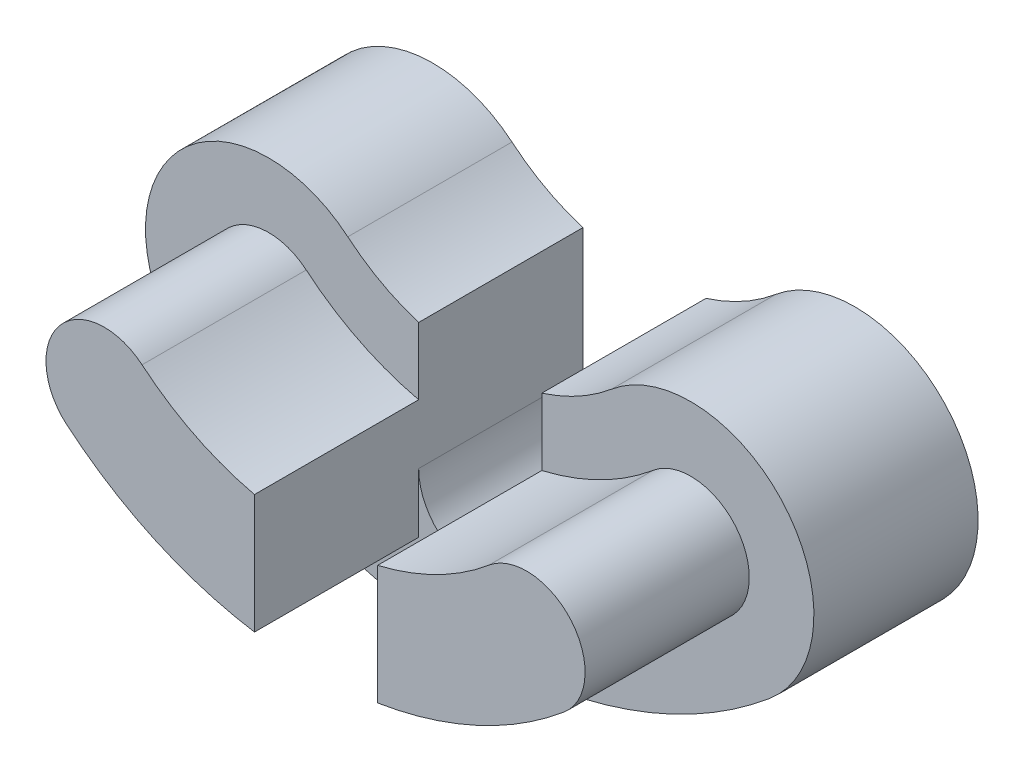
ISO-10303-21;
HEADER;
FILE_DESCRIPTION(('STEP AP214'),'2;1');
FILE_NAME('part.step','',(''),(''),'','','');
FILE_SCHEMA(('AUTOMOTIVE_DESIGN { 1 0 10303 214 1 1 1 1 }'));
ENDSEC;
DATA;
#1=APPLICATION_CONTEXT('core data for automotive mechanical design processes');
#2=APPLICATION_PROTOCOL_DEFINITION('international standard','automotive_design',2000,#1);
#3=PRODUCT_CONTEXT('',#1,'mechanical');
#4=PRODUCT('Part','Part','',(#3));
#5=PRODUCT_RELATED_PRODUCT_CATEGORY('part','',(#4));
#6=PRODUCT_DEFINITION_FORMATION('','',#4);
#7=PRODUCT_DEFINITION_CONTEXT('part definition',#1,'design');
#8=PRODUCT_DEFINITION('design','',#6,#7);
#9=PRODUCT_DEFINITION_SHAPE('','',#8);
#10=(LENGTH_UNIT() NAMED_UNIT(*) SI_UNIT(.MILLI.,.METRE.));
#11=(NAMED_UNIT(*) PLANE_ANGLE_UNIT() SI_UNIT($,.RADIAN.));
#12=(NAMED_UNIT(*) SI_UNIT($,.STERADIAN.) SOLID_ANGLE_UNIT());
#13=UNCERTAINTY_MEASURE_WITH_UNIT(LENGTH_MEASURE(1.E-05),#10,'distance_accuracy_value','');
#14=(GEOMETRIC_REPRESENTATION_CONTEXT(3) GLOBAL_UNCERTAINTY_ASSIGNED_CONTEXT((#13)) GLOBAL_UNIT_ASSIGNED_CONTEXT((#10,
#11,#12)) REPRESENTATION_CONTEXT('',''));
#15=CARTESIAN_POINT('',(0.,0.,0.));
#16=DIRECTION('',(0.,0.,1.));
#17=DIRECTION('',(1.,0.,0.));
#18=AXIS2_PLACEMENT_3D('',#15,#16,#17);
#19=CARTESIAN_POINT('',(0.,0.,0.));
#20=DIRECTION('',(0.,0.,-1.));
#21=DIRECTION('',(-1.,0.,0.));
#22=AXIS2_PLACEMENT_3D('',#19,#20,#21);
#23=PLANE('',#22);
#24=DIRECTION('',(0.,-1.,0.));
#25=VECTOR('',#24,1.);
#26=CARTESIAN_POINT('',(3.02509313560645,0.,0.));
#27=LINE('',#26,#25);
#28=CARTESIAN_POINT('',(3.02509313560645,-9.53146429049109,0.));
#29=VERTEX_POINT('',#28);
#30=CARTESIAN_POINT('',(3.02509313560645,-12.7973165750054,0.));
#31=VERTEX_POINT('',#30);
#32=EDGE_CURVE('E208',#29,#31,#27,.T.);
#33=ORIENTED_EDGE('',*,*,#32,.T.);
#34=CARTESIAN_POINT('',(0.,0.,0.));
#35=DIRECTION('',(0.,0.,1.));
#36=DIRECTION('',(1.,0.,0.));
#37=AXIS2_PLACEMENT_3D('',#34,#35,#36);
#38=CIRCLE('',#37,13.15);
#39=CARTESIAN_POINT('',(8.45265706737801,-10.0734844270145,0.));
#40=VERTEX_POINT('',#39);
#41=EDGE_CURVE('E153',#31,#40,#38,.T.);
#42=ORIENTED_EDGE('',*,*,#41,.T.);
#43=CARTESIAN_POINT('',(10.2846017549847,-12.2567110899036,0.));
#44=DIRECTION('',(0.,0.,1.));
#45=DIRECTION('',(1.,0.,0.));
#46=AXIS2_PLACEMENT_3D('',#43,#44,#45);
#47=CIRCLE('',#46,2.85);
#48=CARTESIAN_POINT('',(12.1165464425913,-14.4399377527927,0.));
#49=VERTEX_POINT('',#48);
#50=EDGE_CURVE('E55',#49,#40,#47,.T.);
#51=ORIENTED_EDGE('',*,*,#50,.F.);
#52=CARTESIAN_POINT('',(0.,0.,0.));
#53=DIRECTION('',(0.,0.,1.));
#54=DIRECTION('',(1.,0.,0.));
#55=AXIS2_PLACEMENT_3D('',#52,#53,#54);
#56=CIRCLE('',#55,18.85);
#57=CARTESIAN_POINT('',(3.02509313560646,-18.6056795500972,0.));
#58=VERTEX_POINT('',#57);
#59=EDGE_CURVE('E51',#58,#49,#56,.T.);
#60=ORIENTED_EDGE('',*,*,#59,.F.);
#61=DIRECTION('',(0.,-1.,0.));
#62=VECTOR('',#61,1.);
#63=CARTESIAN_POINT('',(3.02509313560645,0.,0.));
#64=LINE('',#63,#62);
#65=CARTESIAN_POINT('',(3.02509313560645,-15.7114229629562,0.));
#66=VERTEX_POINT('',#65);
#67=EDGE_CURVE('E11',#66,#58,#64,.T.);
#68=ORIENTED_EDGE('',*,*,#67,.F.);
#69=CARTESIAN_POINT('',(0.0250931356064548,-15.7114229629562,0.));
#70=DIRECTION('',(0.,0.,-1.));
#71=DIRECTION('',(-1.,0.,0.));
#72=AXIS2_PLACEMENT_3D('',#69,#70,#71);
#73=CIRCLE('',#72,3.);
#74=CARTESIAN_POINT('',(-2.97490686439355,-15.7114229629562,0.));
#75=VERTEX_POINT('',#74);
#76=EDGE_CURVE('E205',#66,#75,#73,.T.);
#77=ORIENTED_EDGE('',*,*,#76,.T.);
#78=DIRECTION('',(0.,-1.,0.));
#79=VECTOR('',#78,1.);
#80=CARTESIAN_POINT('',(-2.97490686439355,0.,0.));
#81=LINE('',#80,#79);
#82=CARTESIAN_POINT('',(-2.97490686439355,-18.6137698800695,0.));
#83=VERTEX_POINT('',#82);
#84=EDGE_CURVE('E245',#75,#83,#81,.T.);
#85=ORIENTED_EDGE('',*,*,#84,.T.);
#86=CARTESIAN_POINT('',(0.,0.,0.));
#87=DIRECTION('',(0.,0.,1.));
#88=DIRECTION('',(1.,0.,0.));
#89=AXIS2_PLACEMENT_3D('',#86,#87,#88);
#90=CIRCLE('',#89,18.85);
#91=CARTESIAN_POINT('',(-12.1165464425913,-14.4399377527927,0.));
#92=VERTEX_POINT('',#91);
#93=EDGE_CURVE('E257',#92,#83,#90,.T.);
#94=ORIENTED_EDGE('',*,*,#93,.F.);
#95=CARTESIAN_POINT('',(-10.2846017549847,-12.2567110899036,0.));
#96=DIRECTION('',(0.,0.,1.));
#97=DIRECTION('',(1.,0.,0.));
#98=AXIS2_PLACEMENT_3D('',#95,#96,#97);
#99=CIRCLE('',#98,2.85);
#100=CARTESIAN_POINT('',(-8.45265706737802,-10.0734844270145,0.));
#101=VERTEX_POINT('',#100);
#102=EDGE_CURVE('E254',#101,#92,#99,.T.);
#103=ORIENTED_EDGE('',*,*,#102,.F.);
#104=CARTESIAN_POINT('',(0.,0.,0.));
#105=DIRECTION('',(0.,0.,1.));
#106=DIRECTION('',(1.,0.,0.));
#107=AXIS2_PLACEMENT_3D('',#104,#105,#106);
#108=CIRCLE('',#107,13.15);
#109=CARTESIAN_POINT('',(-2.97490686439355,-12.8090760458428,0.));
#110=VERTEX_POINT('',#109);
#111=EDGE_CURVE('E240',#101,#110,#108,.T.);
#112=ORIENTED_EDGE('',*,*,#111,.T.);
#113=DIRECTION('',(0.,1.,0.));
#114=VECTOR('',#113,1.);
#115=CARTESIAN_POINT('',(-2.97490686439355,0.,0.));
#116=LINE('',#115,#114);
#117=CARTESIAN_POINT('',(-2.97490686439355,-9.54724720263303,0.));
#118=VERTEX_POINT('',#117);
#119=EDGE_CURVE('E156',#110,#118,#116,.T.);
#120=ORIENTED_EDGE('',*,*,#119,.T.);
#121=CARTESIAN_POINT('',(0.,0.,0.));
#122=DIRECTION('',(0.,0.,-1.));
#123=DIRECTION('',(-1.,0.,0.));
#124=AXIS2_PLACEMENT_3D('',#121,#122,#123);
#125=CIRCLE('',#124,10.);
#126=CARTESIAN_POINT('',(-6.42787609686541,-7.66044443118978,0.));
#127=VERTEX_POINT('',#126);
#128=EDGE_CURVE('E188',#118,#127,#125,.T.);
#129=ORIENTED_EDGE('',*,*,#128,.T.);
#130=CARTESIAN_POINT('',(-10.2846017549847,-12.2567110899036,0.));
#131=DIRECTION('',(0.,0.,-1.));
#132=DIRECTION('',(-1.,0.,0.));
#133=AXIS2_PLACEMENT_3D('',#130,#131,#132);
#134=CIRCLE('',#133,6.);
#135=CARTESIAN_POINT('',(-14.1413274131039,-16.8529777486175,0.));
#136=VERTEX_POINT('',#135);
#137=EDGE_CURVE('E217',#136,#127,#134,.T.);
#138=ORIENTED_EDGE('',*,*,#137,.F.);
#139=CARTESIAN_POINT('',(0.,0.,0.));
#140=DIRECTION('',(0.,0.,-1.));
#141=DIRECTION('',(-1.,0.,0.));
#142=AXIS2_PLACEMENT_3D('',#139,#140,#141);
#143=CIRCLE('',#142,22.);
#144=CARTESIAN_POINT('',(14.1413274131039,-16.8529777486175,0.));
#145=VERTEX_POINT('',#144);
#146=EDGE_CURVE('E215',#145,#136,#143,.T.);
#147=ORIENTED_EDGE('',*,*,#146,.F.);
#148=CARTESIAN_POINT('',(10.2846017549847,-12.2567110899036,0.));
#149=DIRECTION('',(0.,0.,-1.));
#150=DIRECTION('',(-1.,0.,0.));
#151=AXIS2_PLACEMENT_3D('',#148,#149,#150);
#152=CIRCLE('',#151,6.);
#153=CARTESIAN_POINT('',(6.42787609686542,-7.66044443118977,0.));
#154=VERTEX_POINT('',#153);
#155=EDGE_CURVE('E213',#154,#145,#152,.T.);
#156=ORIENTED_EDGE('',*,*,#155,.F.);
#157=EDGE_CURVE('E210',#154,#29,#125,.T.);
#158=ORIENTED_EDGE('',*,*,#157,.T.);
#159=EDGE_LOOP('',(#33,#42,#51,#60,#68,#77,#85,#94,#103,#112,#120,#129,#138,#147,#156,#158));
#160=FACE_BOUND('',#159,.T.);
#161=ADVANCED_FACE('F36',(#160),#23,.F.);
#162=CARTESIAN_POINT('',(0.,0.,8.));
#163=DIRECTION('',(0.,0.,-1.));
#164=DIRECTION('',(-1.,0.,0.));
#165=AXIS2_PLACEMENT_3D('',#162,#163,#164);
#166=CYLINDRICAL_SURFACE('',#165,13.15);
#167=ORIENTED_EDGE('',*,*,#111,.F.);
#168=DIRECTION('',(0.,0.,-1.));
#169=VECTOR('',#168,1.);
#170=CARTESIAN_POINT('',(-8.45265706737802,-10.0734844270145,8.));
#171=LINE('',#170,#169);
#172=CARTESIAN_POINT('',(-8.45265706737802,-10.0734844270145,8.));
#173=VERTEX_POINT('',#172);
#174=EDGE_CURVE('E44',#173,#101,#171,.T.);
#175=ORIENTED_EDGE('',*,*,#174,.F.);
#176=CARTESIAN_POINT('',(0.,0.,8.));
#177=DIRECTION('',(0.,0.,1.));
#178=DIRECTION('',(1.,0.,0.));
#179=AXIS2_PLACEMENT_3D('',#176,#177,#178);
#180=CIRCLE('',#179,13.15);
#181=CARTESIAN_POINT('',(-2.97490686439355,-12.8090760458428,8.));
#182=VERTEX_POINT('',#181);
#183=EDGE_CURVE('E241',#173,#182,#180,.T.);
#184=ORIENTED_EDGE('',*,*,#183,.T.);
#185=DIRECTION('',(0.,0.,-1.));
#186=VECTOR('',#185,1.);
#187=CARTESIAN_POINT('',(-2.97490686439355,-12.8090760458428,8.));
#188=LINE('',#187,#186);
#189=EDGE_CURVE('E252',#182,#110,#188,.T.);
#190=ORIENTED_EDGE('',*,*,#189,.T.);
#191=EDGE_LOOP('',(#167,#175,#184,#190));
#192=FACE_BOUND('',#191,.T.);
#193=ADVANCED_FACE('F38',(#192),#166,.F.);
#194=CARTESIAN_POINT('',(-10.2846017549847,-12.2567110899036,8.));
#195=DIRECTION('',(0.,0.,-1.));
#196=DIRECTION('',(-1.,0.,0.));
#197=AXIS2_PLACEMENT_3D('',#194,#195,#196);
#198=CYLINDRICAL_SURFACE('',#197,2.85);
#199=ORIENTED_EDGE('',*,*,#102,.T.);
#200=DIRECTION('',(0.,0.,-1.));
#201=VECTOR('',#200,1.);
#202=CARTESIAN_POINT('',(-12.1165464425913,-14.4399377527927,8.));
#203=LINE('',#202,#201);
#204=CARTESIAN_POINT('',(-12.1165464425913,-14.4399377527927,8.));
#205=VERTEX_POINT('',#204);
#206=EDGE_CURVE('E266',#205,#92,#203,.T.);
#207=ORIENTED_EDGE('',*,*,#206,.F.);
#208=CARTESIAN_POINT('',(-10.2846017549847,-12.2567110899036,8.));
#209=DIRECTION('',(0.,0.,1.));
#210=DIRECTION('',(1.,0.,0.));
#211=AXIS2_PLACEMENT_3D('',#208,#209,#210);
#212=CIRCLE('',#211,2.85);
#213=EDGE_CURVE('E244',#173,#205,#212,.T.);
#214=ORIENTED_EDGE('',*,*,#213,.F.);
#215=ORIENTED_EDGE('',*,*,#174,.T.);
#216=EDGE_LOOP('',(#199,#207,#214,#215));
#217=FACE_BOUND('',#216,.T.);
#218=ADVANCED_FACE('F272',(#217),#198,.T.);
#219=CARTESIAN_POINT('',(0.,0.,8.));
#220=DIRECTION('',(0.,0.,-1.));
#221=DIRECTION('',(-1.,0.,0.));
#222=AXIS2_PLACEMENT_3D('',#219,#220,#221);
#223=CYLINDRICAL_SURFACE('',#222,18.85);
#224=ORIENTED_EDGE('',*,*,#93,.T.);
#225=DIRECTION('',(0.,0.,-1.));
#226=VECTOR('',#225,1.);
#227=CARTESIAN_POINT('',(-2.97490686439355,-18.6137698800695,8.));
#228=LINE('',#227,#226);
#229=CARTESIAN_POINT('',(-2.97490686439355,-18.6137698800695,8.));
#230=VERTEX_POINT('',#229);
#231=EDGE_CURVE('E263',#230,#83,#228,.T.);
#232=ORIENTED_EDGE('',*,*,#231,.F.);
#233=CARTESIAN_POINT('',(0.,0.,8.));
#234=DIRECTION('',(0.,0.,1.));
#235=DIRECTION('',(1.,0.,0.));
#236=AXIS2_PLACEMENT_3D('',#233,#234,#235);
#237=CIRCLE('',#236,18.85);
#238=EDGE_CURVE('E247',#205,#230,#237,.T.);
#239=ORIENTED_EDGE('',*,*,#238,.F.);
#240=ORIENTED_EDGE('',*,*,#206,.T.);
#241=EDGE_LOOP('',(#224,#232,#239,#240));
#242=FACE_BOUND('',#241,.T.);
#243=ADVANCED_FACE('F348',(#242),#223,.T.);
#244=CARTESIAN_POINT('',(-2.97490686439355,0.,8.));
#245=DIRECTION('',(1.,0.,0.));
#246=DIRECTION('',(0.,0.,-1.));
#247=AXIS2_PLACEMENT_3D('',#244,#245,#246);
#248=PLANE('',#247);
#249=ORIENTED_EDGE('',*,*,#84,.F.);
#250=DIRECTION('',(0.,0.,1.));
#251=VECTOR('',#250,1.);
#252=CARTESIAN_POINT('',(-2.97490686439355,-15.7114229629562,-8.));
#253=LINE('',#252,#251);
#254=CARTESIAN_POINT('',(-2.97490686439355,-15.7114229629562,-8.));
#255=VERTEX_POINT('',#254);
#256=EDGE_CURVE('E238',#255,#75,#253,.T.);
#257=ORIENTED_EDGE('',*,*,#256,.F.);
#258=DIRECTION('',(0.,1.,0.));
#259=VECTOR('',#258,1.);
#260=CARTESIAN_POINT('',(-2.97490686439355,0.,-8.));
#261=LINE('',#260,#259);
#262=CARTESIAN_POINT('',(-2.97490686439355,-9.54724720263303,-8.));
#263=VERTEX_POINT('',#262);
#264=EDGE_CURVE('E184',#255,#263,#261,.T.);
#265=ORIENTED_EDGE('',*,*,#264,.T.);
#266=DIRECTION('',(0.,0.,1.));
#267=VECTOR('',#266,1.);
#268=CARTESIAN_POINT('',(-2.97490686439355,-9.54724720263303,-8.));
#269=LINE('',#268,#267);
#270=EDGE_CURVE('E220',#263,#118,#269,.T.);
#271=ORIENTED_EDGE('',*,*,#270,.T.);
#272=ORIENTED_EDGE('',*,*,#119,.F.);
#273=ORIENTED_EDGE('',*,*,#189,.F.);
#274=DIRECTION('',(0.,-1.,0.));
#275=VECTOR('',#274,1.);
#276=CARTESIAN_POINT('',(-2.97490686439355,0.,8.));
#277=LINE('',#276,#275);
#278=EDGE_CURVE('E249',#182,#230,#277,.T.);
#279=ORIENTED_EDGE('',*,*,#278,.T.);
#280=ORIENTED_EDGE('',*,*,#231,.T.);
#281=EDGE_LOOP('',(#249,#257,#265,#271,#272,#273,#279,#280));
#282=FACE_BOUND('',#281,.T.);
#283=ADVANCED_FACE('F280',(#282),#248,.T.);
#284=CARTESIAN_POINT('',(0.,0.,8.));
#285=DIRECTION('',(0.,0.,1.));
#286=DIRECTION('',(1.,0.,0.));
#287=AXIS2_PLACEMENT_3D('',#284,#285,#286);
#288=PLANE('',#287);
#289=ORIENTED_EDGE('',*,*,#183,.F.);
#290=ORIENTED_EDGE('',*,*,#213,.T.);
#291=ORIENTED_EDGE('',*,*,#238,.T.);
#292=ORIENTED_EDGE('',*,*,#278,.F.);
#293=EDGE_LOOP('',(#289,#290,#291,#292));
#294=FACE_BOUND('',#293,.T.);
#295=ADVANCED_FACE('F341',(#294),#288,.T.);
#296=CARTESIAN_POINT('',(0.0250931356064548,-15.7114229629562,-8.));
#297=DIRECTION('',(0.,0.,1.));
#298=DIRECTION('',(1.,0.,0.));
#299=AXIS2_PLACEMENT_3D('',#296,#297,#298);
#300=CYLINDRICAL_SURFACE('',#299,3.);
#301=ORIENTED_EDGE('',*,*,#76,.F.);
#302=DIRECTION('',(0.,0.,1.));
#303=VECTOR('',#302,1.);
#304=CARTESIAN_POINT('',(3.02509313560645,-15.7114229629562,-8.));
#305=LINE('',#304,#303);
#306=CARTESIAN_POINT('',(3.02509313560645,-15.7114229629562,-8.));
#307=VERTEX_POINT('',#306);
#308=EDGE_CURVE('E235',#307,#66,#305,.T.);
#309=ORIENTED_EDGE('',*,*,#308,.F.);
#310=CARTESIAN_POINT('',(0.0250931356064548,-15.7114229629562,-8.));
#311=DIRECTION('',(0.,0.,-1.));
#312=DIRECTION('',(-1.,0.,0.));
#313=AXIS2_PLACEMENT_3D('',#310,#311,#312);
#314=CIRCLE('',#313,3.);
#315=EDGE_CURVE('E187',#307,#255,#314,.T.);
#316=ORIENTED_EDGE('',*,*,#315,.T.);
#317=ORIENTED_EDGE('',*,*,#256,.T.);
#318=EDGE_LOOP('',(#301,#309,#316,#317));
#319=FACE_BOUND('',#318,.T.);
#320=ADVANCED_FACE('F338',(#319),#300,.F.);
#321=CARTESIAN_POINT('',(3.02509313560645,0.,-8.));
#322=DIRECTION('',(-1.,0.,0.));
#323=DIRECTION('',(0.,0.,1.));
#324=AXIS2_PLACEMENT_3D('',#321,#322,#323);
#325=PLANE('',#324);
#326=ORIENTED_EDGE('',*,*,#32,.F.);
#327=DIRECTION('',(0.,0.,1.));
#328=VECTOR('',#327,1.);
#329=CARTESIAN_POINT('',(3.02509313560645,-9.53146429049109,-8.));
#330=LINE('',#329,#328);
#331=CARTESIAN_POINT('',(3.02509313560645,-9.53146429049109,-8.));
#332=VERTEX_POINT('',#331);
#333=EDGE_CURVE('E233',#332,#29,#330,.T.);
#334=ORIENTED_EDGE('',*,*,#333,.F.);
#335=DIRECTION('',(0.,-1.,0.));
#336=VECTOR('',#335,1.);
#337=CARTESIAN_POINT('',(3.02509313560645,0.,-8.));
#338=LINE('',#337,#336);
#339=EDGE_CURVE('E191',#332,#307,#338,.T.);
#340=ORIENTED_EDGE('',*,*,#339,.T.);
#341=ORIENTED_EDGE('',*,*,#308,.T.);
#342=ORIENTED_EDGE('',*,*,#67,.T.);
#343=DIRECTION('',(0.,0.,-1.));
#344=VECTOR('',#343,1.);
#345=CARTESIAN_POINT('',(3.02509313560645,-18.6056795500972,8.));
#346=LINE('',#345,#344);
#347=CARTESIAN_POINT('',(3.02509313560645,-18.6056795500972,8.));
#348=VERTEX_POINT('',#347);
#349=EDGE_CURVE('E157',#348,#58,#346,.T.);
#350=ORIENTED_EDGE('',*,*,#349,.F.);
#351=DIRECTION('',(0.,-1.,0.));
#352=VECTOR('',#351,1.);
#353=CARTESIAN_POINT('',(3.02509313560645,0.,8.));
#354=LINE('',#353,#352);
#355=CARTESIAN_POINT('',(3.02509313560645,-12.7973165750054,8.));
#356=VERTEX_POINT('',#355);
#357=EDGE_CURVE('E160',#356,#348,#354,.T.);
#358=ORIENTED_EDGE('',*,*,#357,.F.);
#359=DIRECTION('',(0.,0.,-1.));
#360=VECTOR('',#359,1.);
#361=CARTESIAN_POINT('',(3.02509313560645,-12.7973165750054,8.));
#362=LINE('',#361,#360);
#363=EDGE_CURVE('E147',#356,#31,#362,.T.);
#364=ORIENTED_EDGE('',*,*,#363,.T.);
#365=EDGE_LOOP('',(#326,#334,#340,#341,#342,#350,#358,#364));
#366=FACE_BOUND('',#365,.T.);
#367=ADVANCED_FACE('F161',(#366),#325,.T.);
#368=CARTESIAN_POINT('',(0.,0.,-8.));
#369=DIRECTION('',(0.,0.,1.));
#370=DIRECTION('',(1.,0.,0.));
#371=AXIS2_PLACEMENT_3D('',#368,#369,#370);
#372=CYLINDRICAL_SURFACE('',#371,10.);
#373=ORIENTED_EDGE('',*,*,#157,.F.);
#374=DIRECTION('',(0.,0.,1.));
#375=VECTOR('',#374,1.);
#376=CARTESIAN_POINT('',(6.42787609686542,-7.66044443118977,-8.));
#377=LINE('',#376,#375);
#378=CARTESIAN_POINT('',(6.42787609686542,-7.66044443118977,-8.));
#379=VERTEX_POINT('',#378);
#380=EDGE_CURVE('E231',#379,#154,#377,.T.);
#381=ORIENTED_EDGE('',*,*,#380,.F.);
#382=CARTESIAN_POINT('',(0.,0.,-8.));
#383=DIRECTION('',(0.,0.,-1.));
#384=DIRECTION('',(-1.,0.,0.));
#385=AXIS2_PLACEMENT_3D('',#382,#383,#384);
#386=CIRCLE('',#385,10.);
#387=EDGE_CURVE('E194',#379,#332,#386,.T.);
#388=ORIENTED_EDGE('',*,*,#387,.T.);
#389=ORIENTED_EDGE('',*,*,#333,.T.);
#390=EDGE_LOOP('',(#373,#381,#388,#389));
#391=FACE_BOUND('',#390,.T.);
#392=ADVANCED_FACE('F305',(#391),#372,.F.);
#393=CARTESIAN_POINT('',(10.2846017549847,-12.2567110899036,-8.));
#394=DIRECTION('',(0.,0.,1.));
#395=DIRECTION('',(1.,0.,0.));
#396=AXIS2_PLACEMENT_3D('',#393,#394,#395);
#397=CYLINDRICAL_SURFACE('',#396,6.);
#398=ORIENTED_EDGE('',*,*,#155,.T.);
#399=DIRECTION('',(0.,0.,1.));
#400=VECTOR('',#399,1.);
#401=CARTESIAN_POINT('',(14.1413274131039,-16.8529777486175,-8.));
#402=LINE('',#401,#400);
#403=CARTESIAN_POINT('',(14.1413274131039,-16.8529777486175,-8.));
#404=VERTEX_POINT('',#403);
#405=EDGE_CURVE('E228',#404,#145,#402,.T.);
#406=ORIENTED_EDGE('',*,*,#405,.F.);
#407=CARTESIAN_POINT('',(10.2846017549847,-12.2567110899036,-8.));
#408=DIRECTION('',(0.,0.,-1.));
#409=DIRECTION('',(-1.,0.,0.));
#410=AXIS2_PLACEMENT_3D('',#407,#408,#409);
#411=CIRCLE('',#410,6.);
#412=EDGE_CURVE('E197',#379,#404,#411,.T.);
#413=ORIENTED_EDGE('',*,*,#412,.F.);
#414=ORIENTED_EDGE('',*,*,#380,.T.);
#415=EDGE_LOOP('',(#398,#406,#413,#414));
#416=FACE_BOUND('',#415,.T.);
#417=ADVANCED_FACE('F301',(#416),#397,.T.);
#418=CARTESIAN_POINT('',(0.,0.,-8.));
#419=DIRECTION('',(0.,0.,1.));
#420=DIRECTION('',(1.,0.,0.));
#421=AXIS2_PLACEMENT_3D('',#418,#419,#420);
#422=CYLINDRICAL_SURFACE('',#421,22.);
#423=ORIENTED_EDGE('',*,*,#146,.T.);
#424=DIRECTION('',(0.,0.,1.));
#425=VECTOR('',#424,1.);
#426=CARTESIAN_POINT('',(-14.1413274131039,-16.8529777486175,-8.));
#427=LINE('',#426,#425);
#428=CARTESIAN_POINT('',(-14.1413274131039,-16.8529777486175,-8.));
#429=VERTEX_POINT('',#428);
#430=EDGE_CURVE('E225',#429,#136,#427,.T.);
#431=ORIENTED_EDGE('',*,*,#430,.F.);
#432=CARTESIAN_POINT('',(0.,0.,-8.));
#433=DIRECTION('',(0.,0.,-1.));
#434=DIRECTION('',(-1.,0.,0.));
#435=AXIS2_PLACEMENT_3D('',#432,#433,#434);
#436=CIRCLE('',#435,22.);
#437=EDGE_CURVE('E200',#404,#429,#436,.T.);
#438=ORIENTED_EDGE('',*,*,#437,.F.);
#439=ORIENTED_EDGE('',*,*,#405,.T.);
#440=EDGE_LOOP('',(#423,#431,#438,#439));
#441=FACE_BOUND('',#440,.T.);
#442=ADVANCED_FACE('F297',(#441),#422,.T.);
#443=CARTESIAN_POINT('',(-10.2846017549847,-12.2567110899036,-8.));
#444=DIRECTION('',(0.,0.,1.));
#445=DIRECTION('',(1.,0.,0.));
#446=AXIS2_PLACEMENT_3D('',#443,#444,#445);
#447=CYLINDRICAL_SURFACE('',#446,6.);
#448=ORIENTED_EDGE('',*,*,#137,.T.);
#449=DIRECTION('',(0.,0.,1.));
#450=VECTOR('',#449,1.);
#451=CARTESIAN_POINT('',(-6.42787609686541,-7.66044443118978,-8.));
#452=LINE('',#451,#450);
#453=CARTESIAN_POINT('',(-6.42787609686541,-7.66044443118978,-8.));
#454=VERTEX_POINT('',#453);
#455=EDGE_CURVE('E223',#454,#127,#452,.T.);
#456=ORIENTED_EDGE('',*,*,#455,.F.);
#457=CARTESIAN_POINT('',(-10.2846017549847,-12.2567110899036,-8.));
#458=DIRECTION('',(0.,0.,-1.));
#459=DIRECTION('',(-1.,0.,0.));
#460=AXIS2_PLACEMENT_3D('',#457,#458,#459);
#461=CIRCLE('',#460,6.);
#462=EDGE_CURVE('E202',#429,#454,#461,.T.);
#463=ORIENTED_EDGE('',*,*,#462,.F.);
#464=ORIENTED_EDGE('',*,*,#430,.T.);
#465=EDGE_LOOP('',(#448,#456,#463,#464));
#466=FACE_BOUND('',#465,.T.);
#467=ADVANCED_FACE('F292',(#466),#447,.T.);
#468=ORIENTED_EDGE('',*,*,#128,.F.);
#469=ORIENTED_EDGE('',*,*,#270,.F.);
#470=EDGE_CURVE('E198',#263,#454,#386,.T.);
#471=ORIENTED_EDGE('',*,*,#470,.T.);
#472=ORIENTED_EDGE('',*,*,#455,.T.);
#473=EDGE_LOOP('',(#468,#469,#471,#472));
#474=FACE_BOUND('',#473,.T.);
#475=ADVANCED_FACE('F286',(#474),#372,.F.);
#476=CARTESIAN_POINT('',(0.,0.,-8.));
#477=DIRECTION('',(0.,0.,-1.));
#478=DIRECTION('',(-1.,0.,0.));
#479=AXIS2_PLACEMENT_3D('',#476,#477,#478);
#480=PLANE('',#479);
#481=ORIENTED_EDGE('',*,*,#264,.F.);
#482=ORIENTED_EDGE('',*,*,#315,.F.);
#483=ORIENTED_EDGE('',*,*,#339,.F.);
#484=ORIENTED_EDGE('',*,*,#387,.F.);
#485=ORIENTED_EDGE('',*,*,#412,.T.);
#486=ORIENTED_EDGE('',*,*,#437,.T.);
#487=ORIENTED_EDGE('',*,*,#462,.T.);
#488=ORIENTED_EDGE('',*,*,#470,.F.);
#489=EDGE_LOOP('',(#481,#482,#483,#484,#485,#486,#487,#488));
#490=FACE_BOUND('',#489,.T.);
#491=ADVANCED_FACE('F319',(#490),#480,.T.);
#492=CARTESIAN_POINT('',(0.,0.,8.));
#493=DIRECTION('',(0.,0.,-1.));
#494=DIRECTION('',(-1.,0.,0.));
#495=AXIS2_PLACEMENT_3D('',#492,#493,#494);
#496=CYLINDRICAL_SURFACE('',#495,13.15);
#497=ORIENTED_EDGE('',*,*,#41,.F.);
#498=ORIENTED_EDGE('',*,*,#363,.F.);
#499=CARTESIAN_POINT('',(0.,0.,8.));
#500=DIRECTION('',(0.,0.,1.));
#501=DIRECTION('',(1.,0.,0.));
#502=AXIS2_PLACEMENT_3D('',#499,#500,#501);
#503=CIRCLE('',#502,13.15);
#504=CARTESIAN_POINT('',(8.45265706737801,-10.0734844270145,8.));
#505=VERTEX_POINT('',#504);
#506=EDGE_CURVE('E152',#356,#505,#503,.T.);
#507=ORIENTED_EDGE('',*,*,#506,.T.);
#508=DIRECTION('',(0.,0.,-1.));
#509=VECTOR('',#508,1.);
#510=CARTESIAN_POINT('',(8.45265706737801,-10.0734844270145,8.));
#511=LINE('',#510,#509);
#512=EDGE_CURVE('E176',#505,#40,#511,.T.);
#513=ORIENTED_EDGE('',*,*,#512,.T.);
#514=EDGE_LOOP('',(#497,#498,#507,#513));
#515=FACE_BOUND('',#514,.T.);
#516=ADVANCED_FACE('F149',(#515),#496,.F.);
#517=CARTESIAN_POINT('',(0.,0.,8.));
#518=DIRECTION('',(0.,0.,-1.));
#519=DIRECTION('',(-1.,0.,0.));
#520=AXIS2_PLACEMENT_3D('',#517,#518,#519);
#521=CYLINDRICAL_SURFACE('',#520,18.85);
#522=ORIENTED_EDGE('',*,*,#59,.T.);
#523=DIRECTION('',(0.,0.,-1.));
#524=VECTOR('',#523,1.);
#525=CARTESIAN_POINT('',(12.1165464425913,-14.4399377527927,8.));
#526=LINE('',#525,#524);
#527=CARTESIAN_POINT('',(12.1165464425913,-14.4399377527927,8.));
#528=VERTEX_POINT('',#527);
#529=EDGE_CURVE('E180',#528,#49,#526,.T.);
#530=ORIENTED_EDGE('',*,*,#529,.F.);
#531=CARTESIAN_POINT('',(0.,0.,8.));
#532=DIRECTION('',(0.,0.,1.));
#533=DIRECTION('',(1.,0.,0.));
#534=AXIS2_PLACEMENT_3D('',#531,#532,#533);
#535=CIRCLE('',#534,18.85);
#536=EDGE_CURVE('E165',#348,#528,#535,.T.);
#537=ORIENTED_EDGE('',*,*,#536,.F.);
#538=ORIENTED_EDGE('',*,*,#349,.T.);
#539=EDGE_LOOP('',(#522,#530,#537,#538));
#540=FACE_BOUND('',#539,.T.);
#541=ADVANCED_FACE('F311',(#540),#521,.T.);
#542=CARTESIAN_POINT('',(10.2846017549847,-12.2567110899036,8.));
#543=DIRECTION('',(0.,0.,-1.));
#544=DIRECTION('',(-1.,0.,0.));
#545=AXIS2_PLACEMENT_3D('',#542,#543,#544);
#546=CYLINDRICAL_SURFACE('',#545,2.85);
#547=ORIENTED_EDGE('',*,*,#50,.T.);
#548=ORIENTED_EDGE('',*,*,#512,.F.);
#549=CARTESIAN_POINT('',(10.2846017549847,-12.2567110899036,8.));
#550=DIRECTION('',(0.,0.,1.));
#551=DIRECTION('',(1.,0.,0.));
#552=AXIS2_PLACEMENT_3D('',#549,#550,#551);
#553=CIRCLE('',#552,2.85);
#554=EDGE_CURVE('E169',#528,#505,#553,.T.);
#555=ORIENTED_EDGE('',*,*,#554,.F.);
#556=ORIENTED_EDGE('',*,*,#529,.T.);
#557=EDGE_LOOP('',(#547,#548,#555,#556));
#558=FACE_BOUND('',#557,.T.);
#559=ADVANCED_FACE('F308',(#558),#546,.T.);
#560=CARTESIAN_POINT('',(0.,0.,8.));
#561=DIRECTION('',(0.,0.,1.));
#562=DIRECTION('',(1.,0.,0.));
#563=AXIS2_PLACEMENT_3D('',#560,#561,#562);
#564=PLANE('',#563);
#565=ORIENTED_EDGE('',*,*,#506,.F.);
#566=ORIENTED_EDGE('',*,*,#357,.T.);
#567=ORIENTED_EDGE('',*,*,#536,.T.);
#568=ORIENTED_EDGE('',*,*,#554,.T.);
#569=EDGE_LOOP('',(#565,#566,#567,#568));
#570=FACE_BOUND('',#569,.T.);
#571=ADVANCED_FACE('F167',(#570),#564,.T.);
#572=CLOSED_SHELL('',(#161,#193,#218,#243,#283,#295,#320,#367,#392,#417,#442,#467,#475,#491,
#516,#541,#559,#571));
#573=MANIFOLD_SOLID_BREP('B2',#572);
#574=ADVANCED_BREP_SHAPE_REPRESENTATION('',(#18,#573),#14);
#575=SHAPE_DEFINITION_REPRESENTATION(#9,#574);
ENDSEC;
END-ISO-10303-21;
